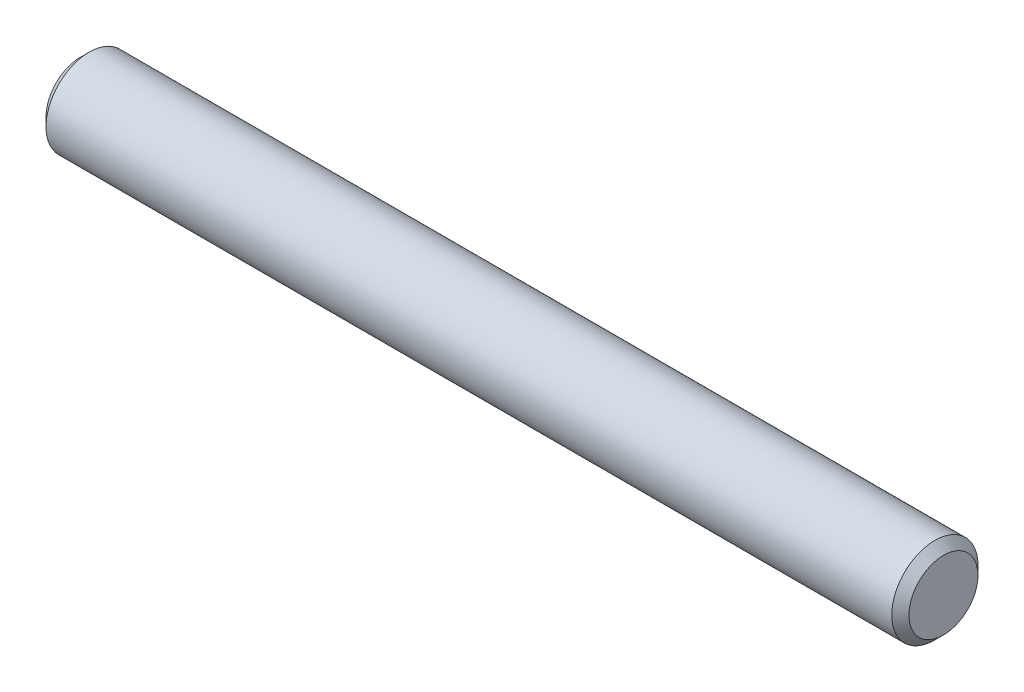
ISO-10303-21;
HEADER;
FILE_DESCRIPTION(('STEP AP214'),'2;1');
FILE_NAME('part.step','',(''),(''),'','','');
FILE_SCHEMA(('AUTOMOTIVE_DESIGN { 1 0 10303 214 1 1 1 1 }'));
ENDSEC;
DATA;
#1=APPLICATION_CONTEXT('core data for automotive mechanical design processes');
#2=APPLICATION_PROTOCOL_DEFINITION('international standard','automotive_design',2000,#1);
#3=PRODUCT_CONTEXT('',#1,'mechanical');
#4=PRODUCT('Part','Part','',(#3));
#5=PRODUCT_RELATED_PRODUCT_CATEGORY('part','',(#4));
#6=PRODUCT_DEFINITION_FORMATION('','',#4);
#7=PRODUCT_DEFINITION_CONTEXT('part definition',#1,'design');
#8=PRODUCT_DEFINITION('design','',#6,#7);
#9=PRODUCT_DEFINITION_SHAPE('','',#8);
#10=(LENGTH_UNIT() NAMED_UNIT(*) SI_UNIT(.MILLI.,.METRE.));
#11=(NAMED_UNIT(*) PLANE_ANGLE_UNIT() SI_UNIT($,.RADIAN.));
#12=(NAMED_UNIT(*) SI_UNIT($,.STERADIAN.) SOLID_ANGLE_UNIT());
#13=UNCERTAINTY_MEASURE_WITH_UNIT(LENGTH_MEASURE(1.E-05),#10,'distance_accuracy_value','');
#14=(GEOMETRIC_REPRESENTATION_CONTEXT(3) GLOBAL_UNCERTAINTY_ASSIGNED_CONTEXT((#13)) GLOBAL_UNIT_ASSIGNED_CONTEXT((#10,
#11,#12)) REPRESENTATION_CONTEXT('',''));
#15=CARTESIAN_POINT('',(0.,0.,0.));
#16=DIRECTION('',(0.,0.,1.));
#17=DIRECTION('',(1.,0.,0.));
#18=AXIS2_PLACEMENT_3D('',#15,#16,#17);
#19=CARTESIAN_POINT('',(-15.875,0.,0.));
#20=DIRECTION('',(1.,0.,0.));
#21=DIRECTION('',(0.,0.,-1.));
#22=AXIS2_PLACEMENT_3D('',#19,#20,#21);
#23=CYLINDRICAL_SURFACE('',#22,1.5875);
#24=CARTESIAN_POINT('',(15.5575,0.,0.));
#25=DIRECTION('',(1.,0.,0.));
#26=DIRECTION('',(0.,0.,-1.));
#27=AXIS2_PLACEMENT_3D('',#24,#25,#26);
#28=CIRCLE('',#27,1.5875);
#29=CARTESIAN_POINT('',(15.5575,0.,-1.5875));
#30=VERTEX_POINT('',#29);
#31=EDGE_CURVE('E37',#30,#30,#28,.F.);
#32=ORIENTED_EDGE('',*,*,#31,.T.);
#33=EDGE_LOOP('',(#32));
#34=FACE_BOUND('',#33,.T.);
#35=CARTESIAN_POINT('',(-15.5575,0.,0.));
#36=DIRECTION('',(1.,0.,0.));
#37=DIRECTION('',(0.,0.,-1.));
#38=AXIS2_PLACEMENT_3D('',#35,#36,#37);
#39=CIRCLE('',#38,1.5875);
#40=CARTESIAN_POINT('',(-15.5575,0.,-1.5875));
#41=VERTEX_POINT('',#40);
#42=EDGE_CURVE('E41',#41,#41,#39,.T.);
#43=ORIENTED_EDGE('',*,*,#42,.T.);
#44=EDGE_LOOP('',(#43));
#45=FACE_BOUND('',#44,.T.);
#46=ADVANCED_FACE('F30',(#34,#45),#23,.T.);
#47=CARTESIAN_POINT('',(-15.875,0.,0.));
#48=DIRECTION('',(1.,0.,0.));
#49=DIRECTION('',(0.,0.,-1.));
#50=AXIS2_PLACEMENT_3D('',#47,#48,#49);
#51=PLANE('',#50);
#52=CARTESIAN_POINT('',(-15.875,0.,0.));
#53=DIRECTION('',(1.,0.,0.));
#54=DIRECTION('',(0.,0.,-1.));
#55=AXIS2_PLACEMENT_3D('',#52,#53,#54);
#56=CIRCLE('',#55,1.27);
#57=CARTESIAN_POINT('',(-15.875,0.,-1.27));
#58=VERTEX_POINT('',#57);
#59=EDGE_CURVE('E10',#58,#58,#56,.F.);
#60=ORIENTED_EDGE('',*,*,#59,.T.);
#61=EDGE_LOOP('',(#60));
#62=FACE_BOUND('',#61,.T.);
#63=ADVANCED_FACE('F61',(#62),#51,.F.);
#64=CARTESIAN_POINT('',(15.875,0.,0.));
#65=DIRECTION('',(1.,0.,0.));
#66=DIRECTION('',(0.,0.,-1.));
#67=AXIS2_PLACEMENT_3D('',#64,#65,#66);
#68=PLANE('',#67);
#69=CARTESIAN_POINT('',(15.875,0.,0.));
#70=DIRECTION('',(1.,0.,0.));
#71=DIRECTION('',(0.,0.,-1.));
#72=AXIS2_PLACEMENT_3D('',#69,#70,#71);
#73=CIRCLE('',#72,1.27);
#74=CARTESIAN_POINT('',(15.875,0.,-1.27));
#75=VERTEX_POINT('',#74);
#76=EDGE_CURVE('E45',#75,#75,#73,.T.);
#77=ORIENTED_EDGE('',*,*,#76,.T.);
#78=EDGE_LOOP('',(#77));
#79=FACE_BOUND('',#78,.T.);
#80=ADVANCED_FACE('F51',(#79),#68,.T.);
#81=CARTESIAN_POINT('',(15.875,0.,0.));
#82=DIRECTION('',(-1.,0.,0.));
#83=DIRECTION('',(0.,0.,1.));
#84=AXIS2_PLACEMENT_3D('',#81,#82,#83);
#85=CONICAL_SURFACE('',#84,1.27,0.785398163397445);
#86=ORIENTED_EDGE('',*,*,#31,.F.);
#87=EDGE_LOOP('',(#86));
#88=FACE_BOUND('',#87,.T.);
#89=ORIENTED_EDGE('',*,*,#76,.F.);
#90=EDGE_LOOP('',(#89));
#91=FACE_BOUND('',#90,.T.);
#92=ADVANCED_FACE('F53',(#88,#91),#85,.T.);
#93=CARTESIAN_POINT('',(-15.5575,0.,0.));
#94=DIRECTION('',(1.,0.,0.));
#95=DIRECTION('',(0.,0.,-1.));
#96=AXIS2_PLACEMENT_3D('',#93,#94,#95);
#97=CONICAL_SURFACE('',#96,1.5875,0.78539816339745);
#98=ORIENTED_EDGE('',*,*,#59,.F.);
#99=EDGE_LOOP('',(#98));
#100=FACE_BOUND('',#99,.T.);
#101=ORIENTED_EDGE('',*,*,#42,.F.);
#102=EDGE_LOOP('',(#101));
#103=FACE_BOUND('',#102,.T.);
#104=ADVANCED_FACE('F32',(#100,#103),#97,.T.);
#105=CLOSED_SHELL('',(#46,#63,#80,#92,#104));
#106=MANIFOLD_SOLID_BREP('B2',#105);
#107=ADVANCED_BREP_SHAPE_REPRESENTATION('',(#18,#106),#14);
#108=SHAPE_DEFINITION_REPRESENTATION(#9,#107);
ENDSEC;
END-ISO-10303-21;
